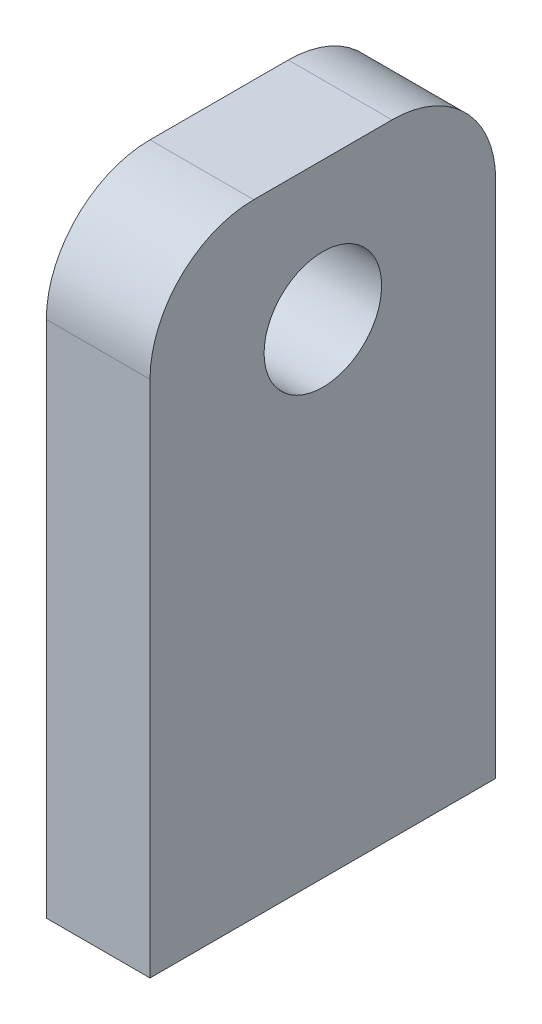
ISO-10303-21;
HEADER;
FILE_DESCRIPTION(('STEP AP214'),'2;1');
FILE_NAME('part.step','',(''),(''),'','','');
FILE_SCHEMA(('AUTOMOTIVE_DESIGN { 1 0 10303 214 1 1 1 1 }'));
ENDSEC;
DATA;
#1=APPLICATION_CONTEXT('core data for automotive mechanical design processes');
#2=APPLICATION_PROTOCOL_DEFINITION('international standard','automotive_design',2000,#1);
#3=PRODUCT_CONTEXT('',#1,'mechanical');
#4=PRODUCT('Part','Part','',(#3));
#5=PRODUCT_RELATED_PRODUCT_CATEGORY('part','',(#4));
#6=PRODUCT_DEFINITION_FORMATION('','',#4);
#7=PRODUCT_DEFINITION_CONTEXT('part definition',#1,'design');
#8=PRODUCT_DEFINITION('design','',#6,#7);
#9=PRODUCT_DEFINITION_SHAPE('','',#8);
#10=(LENGTH_UNIT() NAMED_UNIT(*) SI_UNIT(.MILLI.,.METRE.));
#11=(NAMED_UNIT(*) PLANE_ANGLE_UNIT() SI_UNIT($,.RADIAN.));
#12=(NAMED_UNIT(*) SI_UNIT($,.STERADIAN.) SOLID_ANGLE_UNIT());
#13=UNCERTAINTY_MEASURE_WITH_UNIT(LENGTH_MEASURE(1.E-05),#10,'distance_accuracy_value','');
#14=(GEOMETRIC_REPRESENTATION_CONTEXT(3) GLOBAL_UNCERTAINTY_ASSIGNED_CONTEXT((#13)) GLOBAL_UNIT_ASSIGNED_CONTEXT((#10,
#11,#12)) REPRESENTATION_CONTEXT('',''));
#15=CARTESIAN_POINT('',(0.,0.,0.));
#16=DIRECTION('',(0.,0.,1.));
#17=DIRECTION('',(1.,0.,0.));
#18=AXIS2_PLACEMENT_3D('',#15,#16,#17);
#19=CARTESIAN_POINT('',(-70.,0.,0.));
#20=DIRECTION('',(1.,0.,0.));
#21=DIRECTION('',(0.,0.,-1.));
#22=AXIS2_PLACEMENT_3D('',#19,#20,#21);
#23=PLANE('',#22);
#24=DIRECTION('',(0.,0.,-1.));
#25=VECTOR('',#24,1.);
#26=CARTESIAN_POINT('',(-70.,75.,-25.));
#27=LINE('',#26,#25);
#28=CARTESIAN_POINT('',(-70.,75.,10.));
#29=VERTEX_POINT('',#28);
#30=CARTESIAN_POINT('',(-70.,75.,-9.99999999999999));
#31=VERTEX_POINT('',#30);
#32=EDGE_CURVE('E120',#29,#31,#27,.T.);
#33=ORIENTED_EDGE('',*,*,#32,.T.);
#34=CARTESIAN_POINT('',(-70.,60.,-9.99999999999999));
#35=DIRECTION('',(1.,0.,0.));
#36=DIRECTION('',(0.,0.,-1.));
#37=AXIS2_PLACEMENT_3D('',#34,#35,#36);
#38=CIRCLE('',#37,15.);
#39=CARTESIAN_POINT('',(-70.,60.,-25.));
#40=VERTEX_POINT('',#39);
#41=EDGE_CURVE('E46',#31,#40,#38,.F.);
#42=ORIENTED_EDGE('',*,*,#41,.T.);
#43=DIRECTION('',(0.,-1.,0.));
#44=VECTOR('',#43,1.);
#45=CARTESIAN_POINT('',(-70.,-15.,-25.));
#46=LINE('',#45,#44);
#47=CARTESIAN_POINT('',(-70.,-15.,-25.));
#48=VERTEX_POINT('',#47);
#49=EDGE_CURVE('E92',#40,#48,#46,.T.);
#50=ORIENTED_EDGE('',*,*,#49,.T.);
#51=DIRECTION('',(0.,0.,1.));
#52=VECTOR('',#51,1.);
#53=CARTESIAN_POINT('',(-70.,-15.,-25.));
#54=LINE('',#53,#52);
#55=CARTESIAN_POINT('',(-70.,-15.,25.));
#56=VERTEX_POINT('',#55);
#57=EDGE_CURVE('E95',#48,#56,#54,.T.);
#58=ORIENTED_EDGE('',*,*,#57,.T.);
#59=DIRECTION('',(0.,1.,0.));
#60=VECTOR('',#59,1.);
#61=CARTESIAN_POINT('',(-70.,-15.,25.));
#62=LINE('',#61,#60);
#63=CARTESIAN_POINT('',(-70.,60.,25.));
#64=VERTEX_POINT('',#63);
#65=EDGE_CURVE('E110',#56,#64,#62,.T.);
#66=ORIENTED_EDGE('',*,*,#65,.T.);
#67=CARTESIAN_POINT('',(-70.,60.,10.));
#68=DIRECTION('',(1.,0.,0.));
#69=DIRECTION('',(0.,0.,-1.));
#70=AXIS2_PLACEMENT_3D('',#67,#68,#69);
#71=CIRCLE('',#70,15.);
#72=EDGE_CURVE('E131',#64,#29,#71,.F.);
#73=ORIENTED_EDGE('',*,*,#72,.T.);
#74=EDGE_LOOP('',(#33,#42,#50,#58,#66,#73));
#75=FACE_BOUND('',#74,.T.);
#76=CARTESIAN_POINT('',(-70.,55.,0.));
#77=DIRECTION('',(-1.,0.,0.));
#78=DIRECTION('',(0.,0.,1.));
#79=AXIS2_PLACEMENT_3D('',#76,#77,#78);
#80=CIRCLE('',#79,8.5);
#81=CARTESIAN_POINT('',(-70.,55.,8.5));
#82=VERTEX_POINT('',#81);
#83=EDGE_CURVE('E148',#82,#82,#80,.T.);
#84=ORIENTED_EDGE('',*,*,#83,.F.);
#85=EDGE_LOOP('',(#84));
#86=FACE_BOUND('',#85,.T.);
#87=ADVANCED_FACE('F38',(#75,#86),#23,.F.);
#88=CARTESIAN_POINT('',(-55.,0.,0.));
#89=DIRECTION('',(1.,0.,0.));
#90=DIRECTION('',(0.,0.,-1.));
#91=AXIS2_PLACEMENT_3D('',#88,#89,#90);
#92=PLANE('',#91);
#93=DIRECTION('',(0.,-1.,0.));
#94=VECTOR('',#93,1.);
#95=CARTESIAN_POINT('',(-55.,-15.,-25.));
#96=LINE('',#95,#94);
#97=CARTESIAN_POINT('',(-55.,60.,-25.));
#98=VERTEX_POINT('',#97);
#99=CARTESIAN_POINT('',(-55.,-15.,-25.));
#100=VERTEX_POINT('',#99);
#101=EDGE_CURVE('E114',#98,#100,#96,.T.);
#102=ORIENTED_EDGE('',*,*,#101,.F.);
#103=CARTESIAN_POINT('',(-55.,60.,-9.99999999999999));
#104=DIRECTION('',(1.,0.,0.));
#105=DIRECTION('',(0.,0.,-1.));
#106=AXIS2_PLACEMENT_3D('',#103,#104,#105);
#107=CIRCLE('',#106,15.);
#108=CARTESIAN_POINT('',(-55.,75.,-9.99999999999999));
#109=VERTEX_POINT('',#108);
#110=EDGE_CURVE('E125',#98,#109,#107,.T.);
#111=ORIENTED_EDGE('',*,*,#110,.T.);
#112=DIRECTION('',(0.,0.,-1.));
#113=VECTOR('',#112,1.);
#114=CARTESIAN_POINT('',(-55.,75.,-25.));
#115=LINE('',#114,#113);
#116=CARTESIAN_POINT('',(-55.,75.,10.));
#117=VERTEX_POINT('',#116);
#118=EDGE_CURVE('E102',#117,#109,#115,.T.);
#119=ORIENTED_EDGE('',*,*,#118,.F.);
#120=CARTESIAN_POINT('',(-55.,60.,10.));
#121=DIRECTION('',(1.,0.,0.));
#122=DIRECTION('',(0.,0.,-1.));
#123=AXIS2_PLACEMENT_3D('',#120,#121,#122);
#124=CIRCLE('',#123,15.);
#125=CARTESIAN_POINT('',(-55.,60.,25.));
#126=VERTEX_POINT('',#125);
#127=EDGE_CURVE('E118',#117,#126,#124,.T.);
#128=ORIENTED_EDGE('',*,*,#127,.T.);
#129=DIRECTION('',(0.,1.,0.));
#130=VECTOR('',#129,1.);
#131=CARTESIAN_POINT('',(-55.,-15.,25.));
#132=LINE('',#131,#130);
#133=CARTESIAN_POINT('',(-55.,-15.,25.));
#134=VERTEX_POINT('',#133);
#135=EDGE_CURVE('E142',#134,#126,#132,.T.);
#136=ORIENTED_EDGE('',*,*,#135,.F.);
#137=DIRECTION('',(0.,0.,1.));
#138=VECTOR('',#137,1.);
#139=CARTESIAN_POINT('',(-55.,-15.,-25.));
#140=LINE('',#139,#138);
#141=EDGE_CURVE('E144',#100,#134,#140,.T.);
#142=ORIENTED_EDGE('',*,*,#141,.F.);
#143=EDGE_LOOP('',(#102,#111,#119,#128,#136,#142));
#144=FACE_BOUND('',#143,.T.);
#145=CARTESIAN_POINT('',(-55.,55.,0.));
#146=DIRECTION('',(-1.,0.,0.));
#147=DIRECTION('',(0.,0.,1.));
#148=AXIS2_PLACEMENT_3D('',#145,#146,#147);
#149=CIRCLE('',#148,8.5);
#150=CARTESIAN_POINT('',(-55.,55.,8.5));
#151=VERTEX_POINT('',#150);
#152=EDGE_CURVE('E151',#151,#151,#149,.T.);
#153=ORIENTED_EDGE('',*,*,#152,.T.);
#154=EDGE_LOOP('',(#153));
#155=FACE_BOUND('',#154,.T.);
#156=ADVANCED_FACE('F140',(#144,#155),#92,.T.);
#157=CARTESIAN_POINT('',(-70.,-15.,-25.));
#158=DIRECTION('',(0.,0.,1.));
#159=DIRECTION('',(1.,0.,0.));
#160=AXIS2_PLACEMENT_3D('',#157,#158,#159);
#161=PLANE('',#160);
#162=ORIENTED_EDGE('',*,*,#49,.F.);
#163=DIRECTION('',(1.,0.,0.));
#164=VECTOR('',#163,1.);
#165=CARTESIAN_POINT('',(-70.,60.,-25.));
#166=LINE('',#165,#164);
#167=EDGE_CURVE('E116',#40,#98,#166,.T.);
#168=ORIENTED_EDGE('',*,*,#167,.T.);
#169=ORIENTED_EDGE('',*,*,#101,.T.);
#170=DIRECTION('',(1.,0.,0.));
#171=VECTOR('',#170,1.);
#172=CARTESIAN_POINT('',(-70.,-15.,-25.));
#173=LINE('',#172,#171);
#174=EDGE_CURVE('E107',#48,#100,#173,.T.);
#175=ORIENTED_EDGE('',*,*,#174,.F.);
#176=EDGE_LOOP('',(#162,#168,#169,#175));
#177=FACE_BOUND('',#176,.T.);
#178=ADVANCED_FACE('F112',(#177),#161,.F.);
#179=CARTESIAN_POINT('',(-70.,-15.,-25.));
#180=DIRECTION('',(0.,1.,0.));
#181=DIRECTION('',(0.,0.,1.));
#182=AXIS2_PLACEMENT_3D('',#179,#180,#181);
#183=PLANE('',#182);
#184=ORIENTED_EDGE('',*,*,#141,.T.);
#185=DIRECTION('',(1.,0.,0.));
#186=VECTOR('',#185,1.);
#187=CARTESIAN_POINT('',(-70.,-15.,25.));
#188=LINE('',#187,#186);
#189=EDGE_CURVE('E109',#56,#134,#188,.T.);
#190=ORIENTED_EDGE('',*,*,#189,.F.);
#191=ORIENTED_EDGE('',*,*,#57,.F.);
#192=ORIENTED_EDGE('',*,*,#174,.T.);
#193=EDGE_LOOP('',(#184,#190,#191,#192));
#194=FACE_BOUND('',#193,.T.);
#195=ADVANCED_FACE('F106',(#194),#183,.F.);
#196=CARTESIAN_POINT('',(-70.,-15.,25.));
#197=DIRECTION('',(0.,0.,-1.));
#198=DIRECTION('',(-1.,0.,0.));
#199=AXIS2_PLACEMENT_3D('',#196,#197,#198);
#200=PLANE('',#199);
#201=ORIENTED_EDGE('',*,*,#135,.T.);
#202=DIRECTION('',(1.,0.,0.));
#203=VECTOR('',#202,1.);
#204=CARTESIAN_POINT('',(-70.,60.,25.));
#205=LINE('',#204,#203);
#206=EDGE_CURVE('E11',#126,#64,#205,.F.);
#207=ORIENTED_EDGE('',*,*,#206,.T.);
#208=ORIENTED_EDGE('',*,*,#65,.F.);
#209=ORIENTED_EDGE('',*,*,#189,.T.);
#210=EDGE_LOOP('',(#201,#207,#208,#209));
#211=FACE_BOUND('',#210,.T.);
#212=ADVANCED_FACE('F143',(#211),#200,.F.);
#213=CARTESIAN_POINT('',(-70.,75.,-25.));
#214=DIRECTION('',(0.,-1.,0.));
#215=DIRECTION('',(0.,0.,-1.));
#216=AXIS2_PLACEMENT_3D('',#213,#214,#215);
#217=PLANE('',#216);
#218=ORIENTED_EDGE('',*,*,#118,.T.);
#219=DIRECTION('',(1.,0.,0.));
#220=VECTOR('',#219,1.);
#221=CARTESIAN_POINT('',(-70.,75.,-9.99999999999999));
#222=LINE('',#221,#220);
#223=EDGE_CURVE('E59',#109,#31,#222,.F.);
#224=ORIENTED_EDGE('',*,*,#223,.T.);
#225=ORIENTED_EDGE('',*,*,#32,.F.);
#226=DIRECTION('',(1.,0.,0.));
#227=VECTOR('',#226,1.);
#228=CARTESIAN_POINT('',(-70.,75.,10.));
#229=LINE('',#228,#227);
#230=EDGE_CURVE('E127',#29,#117,#229,.T.);
#231=ORIENTED_EDGE('',*,*,#230,.T.);
#232=EDGE_LOOP('',(#218,#224,#225,#231));
#233=FACE_BOUND('',#232,.T.);
#234=ADVANCED_FACE('F135',(#233),#217,.F.);
#235=CARTESIAN_POINT('',(-70.,55.,0.));
#236=DIRECTION('',(1.,0.,0.));
#237=DIRECTION('',(0.,0.,-1.));
#238=AXIS2_PLACEMENT_3D('',#235,#236,#237);
#239=CYLINDRICAL_SURFACE('',#238,8.5);
#240=ORIENTED_EDGE('',*,*,#83,.T.);
#241=EDGE_LOOP('',(#240));
#242=FACE_BOUND('',#241,.T.);
#243=ORIENTED_EDGE('',*,*,#152,.F.);
#244=EDGE_LOOP('',(#243));
#245=FACE_BOUND('',#244,.T.);
#246=ADVANCED_FACE('F157',(#242,#245),#239,.F.);
#247=CARTESIAN_POINT('',(-70.,60.,-9.99999999999999));
#248=DIRECTION('',(1.,0.,0.));
#249=DIRECTION('',(0.,0.,-1.));
#250=AXIS2_PLACEMENT_3D('',#247,#248,#249);
#251=CYLINDRICAL_SURFACE('',#250,15.);
#252=ORIENTED_EDGE('',*,*,#41,.F.);
#253=ORIENTED_EDGE('',*,*,#223,.F.);
#254=ORIENTED_EDGE('',*,*,#110,.F.);
#255=ORIENTED_EDGE('',*,*,#167,.F.);
#256=EDGE_LOOP('',(#252,#253,#254,#255));
#257=FACE_BOUND('',#256,.T.);
#258=ADVANCED_FACE('F174',(#257),#251,.T.);
#259=CARTESIAN_POINT('',(-70.,60.,10.));
#260=DIRECTION('',(1.,0.,0.));
#261=DIRECTION('',(0.,0.,-1.));
#262=AXIS2_PLACEMENT_3D('',#259,#260,#261);
#263=CYLINDRICAL_SURFACE('',#262,15.);
#264=ORIENTED_EDGE('',*,*,#72,.F.);
#265=ORIENTED_EDGE('',*,*,#206,.F.);
#266=ORIENTED_EDGE('',*,*,#127,.F.);
#267=ORIENTED_EDGE('',*,*,#230,.F.);
#268=EDGE_LOOP('',(#264,#265,#266,#267));
#269=FACE_BOUND('',#268,.T.);
#270=ADVANCED_FACE('F40',(#269),#263,.T.);
#271=CLOSED_SHELL('',(#87,#156,#178,#195,#212,#234,#246,#258,#270));
#272=MANIFOLD_SOLID_BREP('B2',#271);
#273=ADVANCED_BREP_SHAPE_REPRESENTATION('',(#18,#272),#14);
#274=SHAPE_DEFINITION_REPRESENTATION(#9,#273);
ENDSEC;
END-ISO-10303-21;
